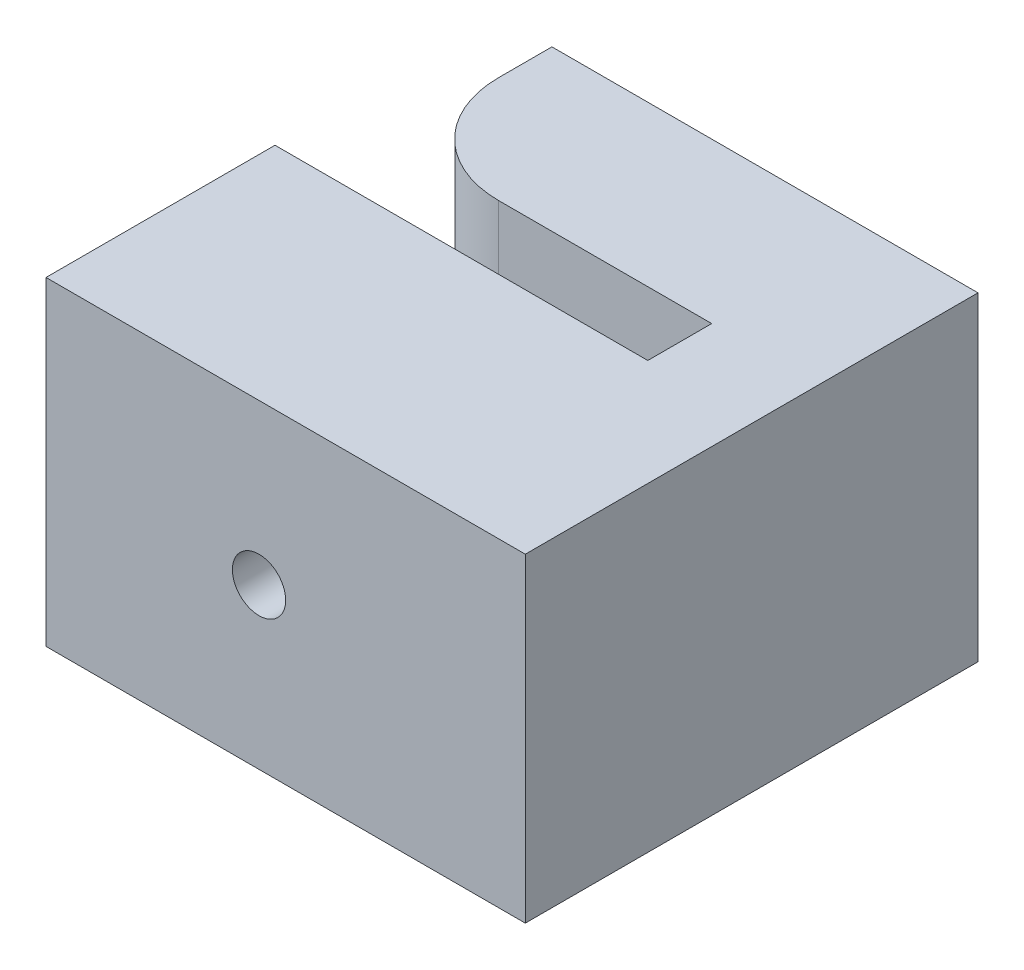
ISO-10303-21;
HEADER;
FILE_DESCRIPTION(('STEP AP214'),'2;1');
FILE_NAME('part.step','',(''),(''),'','','');
FILE_SCHEMA(('AUTOMOTIVE_DESIGN { 1 0 10303 214 1 1 1 1 }'));
ENDSEC;
DATA;
#1=APPLICATION_CONTEXT('core data for automotive mechanical design processes');
#2=APPLICATION_PROTOCOL_DEFINITION('international standard','automotive_design',2000,#1);
#3=PRODUCT_CONTEXT('',#1,'mechanical');
#4=PRODUCT('Part','Part','',(#3));
#5=PRODUCT_RELATED_PRODUCT_CATEGORY('part','',(#4));
#6=PRODUCT_DEFINITION_FORMATION('','',#4);
#7=PRODUCT_DEFINITION_CONTEXT('part definition',#1,'design');
#8=PRODUCT_DEFINITION('design','',#6,#7);
#9=PRODUCT_DEFINITION_SHAPE('','',#8);
#10=(LENGTH_UNIT() NAMED_UNIT(*) SI_UNIT(.MILLI.,.METRE.));
#11=(NAMED_UNIT(*) PLANE_ANGLE_UNIT() SI_UNIT($,.RADIAN.));
#12=(NAMED_UNIT(*) SI_UNIT($,.STERADIAN.) SOLID_ANGLE_UNIT());
#13=UNCERTAINTY_MEASURE_WITH_UNIT(LENGTH_MEASURE(1.E-05),#10,'distance_accuracy_value','');
#14=(GEOMETRIC_REPRESENTATION_CONTEXT(3) GLOBAL_UNCERTAINTY_ASSIGNED_CONTEXT((#13)) GLOBAL_UNIT_ASSIGNED_CONTEXT((#10,
#11,#12)) REPRESENTATION_CONTEXT('',''));
#15=CARTESIAN_POINT('',(0.,0.,0.));
#16=DIRECTION('',(0.,0.,1.));
#17=DIRECTION('',(1.,0.,0.));
#18=AXIS2_PLACEMENT_3D('',#15,#16,#17);
#19=CARTESIAN_POINT('',(4.,3.,4.25));
#20=DIRECTION('',(-1.,0.,0.));
#21=DIRECTION('',(0.,0.,1.));
#22=AXIS2_PLACEMENT_3D('',#19,#20,#21);
#23=PLANE('',#22);
#24=DIRECTION('',(0.,0.,-1.));
#25=VECTOR('',#24,1.);
#26=CARTESIAN_POINT('',(4.,-3.,4.25));
#27=LINE('',#26,#25);
#28=CARTESIAN_POINT('',(4.,-3.,4.25));
#29=VERTEX_POINT('',#28);
#30=CARTESIAN_POINT('',(4.,-3.,-4.25));
#31=VERTEX_POINT('',#30);
#32=EDGE_CURVE('E139',#29,#31,#27,.T.);
#33=ORIENTED_EDGE('',*,*,#32,.T.);
#34=DIRECTION('',(0.,-1.,0.));
#35=VECTOR('',#34,1.);
#36=CARTESIAN_POINT('',(4.,3.,-4.25));
#37=LINE('',#36,#35);
#38=CARTESIAN_POINT('',(4.,3.,-4.25));
#39=VERTEX_POINT('',#38);
#40=EDGE_CURVE('E119',#39,#31,#37,.T.);
#41=ORIENTED_EDGE('',*,*,#40,.F.);
#42=DIRECTION('',(0.,0.,-1.));
#43=VECTOR('',#42,1.);
#44=CARTESIAN_POINT('',(4.,3.,4.25));
#45=LINE('',#44,#43);
#46=CARTESIAN_POINT('',(4.,3.,4.25));
#47=VERTEX_POINT('',#46);
#48=EDGE_CURVE('E126',#47,#39,#45,.T.);
#49=ORIENTED_EDGE('',*,*,#48,.F.);
#50=DIRECTION('',(0.,-1.,0.));
#51=VECTOR('',#50,1.);
#52=CARTESIAN_POINT('',(4.,3.,4.25));
#53=LINE('',#52,#51);
#54=EDGE_CURVE('E168',#47,#29,#53,.T.);
#55=ORIENTED_EDGE('',*,*,#54,.T.);
#56=EDGE_LOOP('',(#33,#41,#49,#55));
#57=FACE_BOUND('',#56,.T.);
#58=ADVANCED_FACE('F43',(#57),#23,.F.);
#59=CARTESIAN_POINT('',(-4.,3.,-4.25));
#60=DIRECTION('',(0.,0.,1.));
#61=DIRECTION('',(1.,0.,0.));
#62=AXIS2_PLACEMENT_3D('',#59,#60,#61);
#63=PLANE('',#62);
#64=CARTESIAN_POINT('',(-0.999999999999998,0.,-4.25));
#65=DIRECTION('',(0.,0.,-1.));
#66=DIRECTION('',(-1.,0.,0.));
#67=AXIS2_PLACEMENT_3D('',#64,#65,#66);
#68=CIRCLE('',#67,0.5);
#69=CARTESIAN_POINT('',(-1.5,0.,-4.25));
#70=VERTEX_POINT('',#69);
#71=EDGE_CURVE('E220',#70,#70,#68,.T.);
#72=ORIENTED_EDGE('',*,*,#71,.F.);
#73=EDGE_LOOP('',(#72));
#74=FACE_BOUND('',#73,.T.);
#75=DIRECTION('',(-1.,0.,0.));
#76=VECTOR('',#75,1.);
#77=CARTESIAN_POINT('',(-4.,-3.,-4.25));
#78=LINE('',#77,#76);
#79=CARTESIAN_POINT('',(-4.,-3.,-4.25));
#80=VERTEX_POINT('',#79);
#81=EDGE_CURVE('E190',#31,#80,#78,.T.);
#82=ORIENTED_EDGE('',*,*,#81,.T.);
#83=DIRECTION('',(0.,-1.,0.));
#84=VECTOR('',#83,1.);
#85=CARTESIAN_POINT('',(-4.,3.,-4.25));
#86=LINE('',#85,#84);
#87=CARTESIAN_POINT('',(-4.,3.,-4.25));
#88=VERTEX_POINT('',#87);
#89=EDGE_CURVE('E122',#88,#80,#86,.T.);
#90=ORIENTED_EDGE('',*,*,#89,.F.);
#91=DIRECTION('',(-1.,0.,0.));
#92=VECTOR('',#91,1.);
#93=CARTESIAN_POINT('',(-4.,3.,-4.25));
#94=LINE('',#93,#92);
#95=EDGE_CURVE('E115',#39,#88,#94,.T.);
#96=ORIENTED_EDGE('',*,*,#95,.F.);
#97=ORIENTED_EDGE('',*,*,#40,.T.);
#98=EDGE_LOOP('',(#82,#90,#96,#97));
#99=FACE_BOUND('',#98,.T.);
#100=ADVANCED_FACE('F117',(#74,#99),#63,.F.);
#101=CARTESIAN_POINT('',(-4.,3.,-1.25));
#102=DIRECTION('',(1.,0.,0.));
#103=DIRECTION('',(0.,0.,-1.));
#104=AXIS2_PLACEMENT_3D('',#101,#102,#103);
#105=PLANE('',#104);
#106=DIRECTION('',(0.,0.,1.));
#107=VECTOR('',#106,1.);
#108=CARTESIAN_POINT('',(-4.,-3.,-1.25));
#109=LINE('',#108,#107);
#110=CARTESIAN_POINT('',(-4.,-3.,-3.25));
#111=VERTEX_POINT('',#110);
#112=EDGE_CURVE('E187',#80,#111,#109,.T.);
#113=ORIENTED_EDGE('',*,*,#112,.T.);
#114=DIRECTION('',(0.,-1.,0.));
#115=VECTOR('',#114,1.);
#116=CARTESIAN_POINT('',(-4.,3.,-3.25));
#117=LINE('',#116,#115);
#118=CARTESIAN_POINT('',(-4.,3.,-3.25));
#119=VERTEX_POINT('',#118);
#120=EDGE_CURVE('E52',#111,#119,#117,.F.);
#121=ORIENTED_EDGE('',*,*,#120,.T.);
#122=DIRECTION('',(0.,0.,1.));
#123=VECTOR('',#122,1.);
#124=CARTESIAN_POINT('',(-4.,3.,-1.25));
#125=LINE('',#124,#123);
#126=EDGE_CURVE('E125',#88,#119,#125,.T.);
#127=ORIENTED_EDGE('',*,*,#126,.F.);
#128=ORIENTED_EDGE('',*,*,#89,.T.);
#129=EDGE_LOOP('',(#113,#121,#127,#128));
#130=FACE_BOUND('',#129,.T.);
#131=ADVANCED_FACE('F266',(#130),#105,.F.);
#132=CARTESIAN_POINT('',(-4.,3.,-1.25));
#133=DIRECTION('',(0.,0.,-1.));
#134=DIRECTION('',(-1.,0.,0.));
#135=AXIS2_PLACEMENT_3D('',#132,#133,#134);
#136=PLANE('',#135);
#137=CARTESIAN_POINT('',(-0.999999999999998,0.,-1.25));
#138=DIRECTION('',(0.,0.,-1.));
#139=DIRECTION('',(-1.,0.,0.));
#140=AXIS2_PLACEMENT_3D('',#137,#138,#139);
#141=CIRCLE('',#140,0.5);
#142=CARTESIAN_POINT('',(-1.5,0.,-1.25));
#143=VERTEX_POINT('',#142);
#144=EDGE_CURVE('E195',#143,#143,#141,.T.);
#145=ORIENTED_EDGE('',*,*,#144,.T.);
#146=EDGE_LOOP('',(#145));
#147=FACE_BOUND('',#146,.T.);
#148=DIRECTION('',(1.,0.,0.));
#149=VECTOR('',#148,1.);
#150=CARTESIAN_POINT('',(-4.,3.,-1.25));
#151=LINE('',#150,#149);
#152=CARTESIAN_POINT('',(-2.,3.,-1.25));
#153=VERTEX_POINT('',#152);
#154=CARTESIAN_POINT('',(2.,3.,-1.25));
#155=VERTEX_POINT('',#154);
#156=EDGE_CURVE('E207',#153,#155,#151,.T.);
#157=ORIENTED_EDGE('',*,*,#156,.F.);
#158=DIRECTION('',(0.,-1.,0.));
#159=VECTOR('',#158,1.);
#160=CARTESIAN_POINT('',(-2.,3.,-1.25));
#161=LINE('',#160,#159);
#162=CARTESIAN_POINT('',(-2.,-3.,-1.25));
#163=VERTEX_POINT('',#162);
#164=EDGE_CURVE('E141',#153,#163,#161,.T.);
#165=ORIENTED_EDGE('',*,*,#164,.T.);
#166=DIRECTION('',(1.,0.,0.));
#167=VECTOR('',#166,1.);
#168=CARTESIAN_POINT('',(-4.,-3.,-1.25));
#169=LINE('',#168,#167);
#170=CARTESIAN_POINT('',(2.,-3.,-1.25));
#171=VERTEX_POINT('',#170);
#172=EDGE_CURVE('E184',#163,#171,#169,.T.);
#173=ORIENTED_EDGE('',*,*,#172,.T.);
#174=DIRECTION('',(0.,-1.,0.));
#175=VECTOR('',#174,1.);
#176=CARTESIAN_POINT('',(2.,3.,-1.25));
#177=LINE('',#176,#175);
#178=EDGE_CURVE('E147',#155,#171,#177,.T.);
#179=ORIENTED_EDGE('',*,*,#178,.F.);
#180=EDGE_LOOP('',(#157,#165,#173,#179));
#181=FACE_BOUND('',#180,.T.);
#182=ADVANCED_FACE('F272',(#147,#181),#136,.F.);
#183=CARTESIAN_POINT('',(2.,3.,-1.25));
#184=DIRECTION('',(1.,0.,0.));
#185=DIRECTION('',(0.,0.,-1.));
#186=AXIS2_PLACEMENT_3D('',#183,#184,#185);
#187=PLANE('',#186);
#188=DIRECTION('',(0.,0.,1.));
#189=VECTOR('',#188,1.);
#190=CARTESIAN_POINT('',(2.,-3.,-1.25));
#191=LINE('',#190,#189);
#192=CARTESIAN_POINT('',(2.,-3.,-0.0500000000000014));
#193=VERTEX_POINT('',#192);
#194=EDGE_CURVE('E180',#171,#193,#191,.T.);
#195=ORIENTED_EDGE('',*,*,#194,.T.);
#196=DIRECTION('',(0.,-1.,0.));
#197=VECTOR('',#196,1.);
#198=CARTESIAN_POINT('',(2.,3.,-0.0500000000000014));
#199=LINE('',#198,#197);
#200=CARTESIAN_POINT('',(2.,3.,-0.0500000000000014));
#201=VERTEX_POINT('',#200);
#202=EDGE_CURVE('E156',#201,#193,#199,.T.);
#203=ORIENTED_EDGE('',*,*,#202,.F.);
#204=DIRECTION('',(0.,0.,1.));
#205=VECTOR('',#204,1.);
#206=CARTESIAN_POINT('',(2.,3.,-1.25));
#207=LINE('',#206,#205);
#208=EDGE_CURVE('E204',#155,#201,#207,.T.);
#209=ORIENTED_EDGE('',*,*,#208,.F.);
#210=ORIENTED_EDGE('',*,*,#178,.T.);
#211=EDGE_LOOP('',(#195,#203,#209,#210));
#212=FACE_BOUND('',#211,.T.);
#213=ADVANCED_FACE('F243',(#212),#187,.F.);
#214=CARTESIAN_POINT('',(-4.,3.,-0.0500000000000014));
#215=DIRECTION('',(0.,0.,1.));
#216=DIRECTION('',(1.,0.,0.));
#217=AXIS2_PLACEMENT_3D('',#214,#215,#216);
#218=PLANE('',#217);
#219=CARTESIAN_POINT('',(-0.999999999999998,0.,-0.0500000000000014));
#220=DIRECTION('',(0.,0.,1.));
#221=DIRECTION('',(1.,0.,0.));
#222=AXIS2_PLACEMENT_3D('',#219,#220,#221);
#223=CIRCLE('',#222,0.5);
#224=CARTESIAN_POINT('',(-0.499999999999998,0.,-0.0500000000000015));
#225=VERTEX_POINT('',#224);
#226=EDGE_CURVE('E215',#225,#225,#223,.T.);
#227=ORIENTED_EDGE('',*,*,#226,.T.);
#228=EDGE_LOOP('',(#227));
#229=FACE_BOUND('',#228,.T.);
#230=DIRECTION('',(-1.,0.,0.));
#231=VECTOR('',#230,1.);
#232=CARTESIAN_POINT('',(-4.,-3.,-0.0500000000000014));
#233=LINE('',#232,#231);
#234=CARTESIAN_POINT('',(-5.,-3.,-0.0500000000000013));
#235=VERTEX_POINT('',#234);
#236=EDGE_CURVE('E177',#193,#235,#233,.T.);
#237=ORIENTED_EDGE('',*,*,#236,.T.);
#238=DIRECTION('',(0.,-1.,0.));
#239=VECTOR('',#238,1.);
#240=CARTESIAN_POINT('',(-5.,3.,-0.0500000000000013));
#241=LINE('',#240,#239);
#242=CARTESIAN_POINT('',(-5.,3.,-0.0500000000000013));
#243=VERTEX_POINT('',#242);
#244=EDGE_CURVE('E160',#243,#235,#241,.T.);
#245=ORIENTED_EDGE('',*,*,#244,.F.);
#246=DIRECTION('',(-1.,0.,0.));
#247=VECTOR('',#246,1.);
#248=CARTESIAN_POINT('',(-4.,3.,-0.0500000000000014));
#249=LINE('',#248,#247);
#250=EDGE_CURVE('E201',#201,#243,#249,.T.);
#251=ORIENTED_EDGE('',*,*,#250,.F.);
#252=ORIENTED_EDGE('',*,*,#202,.T.);
#253=EDGE_LOOP('',(#237,#245,#251,#252));
#254=FACE_BOUND('',#253,.T.);
#255=ADVANCED_FACE('F239',(#229,#254),#218,.F.);
#256=CARTESIAN_POINT('',(-5.,3.,-0.0500000000000013));
#257=DIRECTION('',(1.,0.,0.));
#258=DIRECTION('',(0.,0.,-1.));
#259=AXIS2_PLACEMENT_3D('',#256,#257,#258);
#260=PLANE('',#259);
#261=DIRECTION('',(0.,0.,1.));
#262=VECTOR('',#261,1.);
#263=CARTESIAN_POINT('',(-5.,-3.,-0.0500000000000013));
#264=LINE('',#263,#262);
#265=CARTESIAN_POINT('',(-5.,-3.,4.25));
#266=VERTEX_POINT('',#265);
#267=EDGE_CURVE('E173',#235,#266,#264,.T.);
#268=ORIENTED_EDGE('',*,*,#267,.T.);
#269=DIRECTION('',(0.,-1.,0.));
#270=VECTOR('',#269,1.);
#271=CARTESIAN_POINT('',(-5.,3.,4.25));
#272=LINE('',#271,#270);
#273=CARTESIAN_POINT('',(-5.,3.,4.25));
#274=VERTEX_POINT('',#273);
#275=EDGE_CURVE('E164',#274,#266,#272,.T.);
#276=ORIENTED_EDGE('',*,*,#275,.F.);
#277=DIRECTION('',(0.,0.,1.));
#278=VECTOR('',#277,1.);
#279=CARTESIAN_POINT('',(-5.,3.,-0.0500000000000013));
#280=LINE('',#279,#278);
#281=EDGE_CURVE('E198',#243,#274,#280,.T.);
#282=ORIENTED_EDGE('',*,*,#281,.F.);
#283=ORIENTED_EDGE('',*,*,#244,.T.);
#284=EDGE_LOOP('',(#268,#276,#282,#283));
#285=FACE_BOUND('',#284,.T.);
#286=ADVANCED_FACE('F242',(#285),#260,.F.);
#287=CARTESIAN_POINT('',(-4.,3.,4.25));
#288=DIRECTION('',(0.,0.,-1.));
#289=DIRECTION('',(-1.,0.,0.));
#290=AXIS2_PLACEMENT_3D('',#287,#288,#289);
#291=PLANE('',#290);
#292=CARTESIAN_POINT('',(-0.999999999999998,0.,4.25));
#293=DIRECTION('',(0.,0.,-1.));
#294=DIRECTION('',(-1.,0.,0.));
#295=AXIS2_PLACEMENT_3D('',#292,#293,#294);
#296=CIRCLE('',#295,0.5);
#297=CARTESIAN_POINT('',(-1.5,0.,4.25));
#298=VERTEX_POINT('',#297);
#299=EDGE_CURVE('E219',#298,#298,#296,.T.);
#300=ORIENTED_EDGE('',*,*,#299,.T.);
#301=EDGE_LOOP('',(#300));
#302=FACE_BOUND('',#301,.T.);
#303=DIRECTION('',(1.,0.,0.));
#304=VECTOR('',#303,1.);
#305=CARTESIAN_POINT('',(-4.,-3.,4.25));
#306=LINE('',#305,#304);
#307=EDGE_CURVE('E136',#266,#29,#306,.T.);
#308=ORIENTED_EDGE('',*,*,#307,.T.);
#309=ORIENTED_EDGE('',*,*,#54,.F.);
#310=DIRECTION('',(1.,0.,0.));
#311=VECTOR('',#310,1.);
#312=CARTESIAN_POINT('',(-4.,3.,4.25));
#313=LINE('',#312,#311);
#314=EDGE_CURVE('E131',#274,#47,#313,.T.);
#315=ORIENTED_EDGE('',*,*,#314,.F.);
#316=ORIENTED_EDGE('',*,*,#275,.T.);
#317=EDGE_LOOP('',(#308,#309,#315,#316));
#318=FACE_BOUND('',#317,.T.);
#319=ADVANCED_FACE('F228',(#302,#318),#291,.F.);
#320=CARTESIAN_POINT('',(0.,3.,0.));
#321=DIRECTION('',(0.,-1.,0.));
#322=DIRECTION('',(0.,0.,-1.));
#323=AXIS2_PLACEMENT_3D('',#320,#321,#322);
#324=PLANE('',#323);
#325=ORIENTED_EDGE('',*,*,#126,.T.);
#326=CARTESIAN_POINT('',(-2.,3.,-3.25));
#327=DIRECTION('',(0.,-1.,0.));
#328=DIRECTION('',(0.,0.,-1.));
#329=AXIS2_PLACEMENT_3D('',#326,#327,#328);
#330=CIRCLE('',#329,2.);
#331=EDGE_CURVE('E11',#119,#153,#330,.F.);
#332=ORIENTED_EDGE('',*,*,#331,.T.);
#333=ORIENTED_EDGE('',*,*,#156,.T.);
#334=ORIENTED_EDGE('',*,*,#208,.T.);
#335=ORIENTED_EDGE('',*,*,#250,.T.);
#336=ORIENTED_EDGE('',*,*,#281,.T.);
#337=ORIENTED_EDGE('',*,*,#314,.T.);
#338=ORIENTED_EDGE('',*,*,#48,.T.);
#339=ORIENTED_EDGE('',*,*,#95,.T.);
#340=EDGE_LOOP('',(#325,#332,#333,#334,#335,#336,#337,#338,#339));
#341=FACE_BOUND('',#340,.T.);
#342=ADVANCED_FACE('F129',(#341),#324,.F.);
#343=CARTESIAN_POINT('',(0.,-3.,0.));
#344=DIRECTION('',(0.,-1.,0.));
#345=DIRECTION('',(0.,0.,-1.));
#346=AXIS2_PLACEMENT_3D('',#343,#344,#345);
#347=PLANE('',#346);
#348=ORIENTED_EDGE('',*,*,#172,.F.);
#349=CARTESIAN_POINT('',(-2.,-3.,-3.25));
#350=DIRECTION('',(0.,-1.,0.));
#351=DIRECTION('',(0.,0.,-1.));
#352=AXIS2_PLACEMENT_3D('',#349,#350,#351);
#353=CIRCLE('',#352,2.);
#354=EDGE_CURVE('E66',#163,#111,#353,.T.);
#355=ORIENTED_EDGE('',*,*,#354,.T.);
#356=ORIENTED_EDGE('',*,*,#112,.F.);
#357=ORIENTED_EDGE('',*,*,#81,.F.);
#358=ORIENTED_EDGE('',*,*,#32,.F.);
#359=ORIENTED_EDGE('',*,*,#307,.F.);
#360=ORIENTED_EDGE('',*,*,#267,.F.);
#361=ORIENTED_EDGE('',*,*,#236,.F.);
#362=ORIENTED_EDGE('',*,*,#194,.F.);
#363=EDGE_LOOP('',(#348,#355,#356,#357,#358,#359,#360,#361,#362));
#364=FACE_BOUND('',#363,.T.);
#365=ADVANCED_FACE('F235',(#364),#347,.T.);
#366=CARTESIAN_POINT('',(-0.999999999999998,0.,4.25));
#367=DIRECTION('',(0.,0.,-1.));
#368=DIRECTION('',(-1.,0.,0.));
#369=AXIS2_PLACEMENT_3D('',#366,#367,#368);
#370=CYLINDRICAL_SURFACE('',#369,0.5);
#371=ORIENTED_EDGE('',*,*,#299,.F.);
#372=EDGE_LOOP('',(#371));
#373=FACE_BOUND('',#372,.T.);
#374=ORIENTED_EDGE('',*,*,#226,.F.);
#375=EDGE_LOOP('',(#374));
#376=FACE_BOUND('',#375,.T.);
#377=ADVANCED_FACE('F231',(#373,#376),#370,.F.);
#378=ORIENTED_EDGE('',*,*,#71,.T.);
#379=EDGE_LOOP('',(#378));
#380=FACE_BOUND('',#379,.T.);
#381=ORIENTED_EDGE('',*,*,#144,.F.);
#382=EDGE_LOOP('',(#381));
#383=FACE_BOUND('',#382,.T.);
#384=ADVANCED_FACE('F234',(#380,#383),#370,.F.);
#385=CARTESIAN_POINT('',(-2.,3.,-3.25));
#386=DIRECTION('',(0.,-1.,0.));
#387=DIRECTION('',(0.,0.,-1.));
#388=AXIS2_PLACEMENT_3D('',#385,#386,#387);
#389=CYLINDRICAL_SURFACE('',#388,2.);
#390=ORIENTED_EDGE('',*,*,#331,.F.);
#391=ORIENTED_EDGE('',*,*,#120,.F.);
#392=ORIENTED_EDGE('',*,*,#354,.F.);
#393=ORIENTED_EDGE('',*,*,#164,.F.);
#394=EDGE_LOOP('',(#390,#391,#392,#393));
#395=FACE_BOUND('',#394,.T.);
#396=ADVANCED_FACE('F45',(#395),#389,.T.);
#397=CLOSED_SHELL('',(#58,#100,#131,#182,#213,#255,#286,#319,#342,#365,#377,#384,#396));
#398=MANIFOLD_SOLID_BREP('B2',#397);
#399=ADVANCED_BREP_SHAPE_REPRESENTATION('',(#18,#398),#14);
#400=SHAPE_DEFINITION_REPRESENTATION(#9,#399);
ENDSEC;
END-ISO-10303-21;
